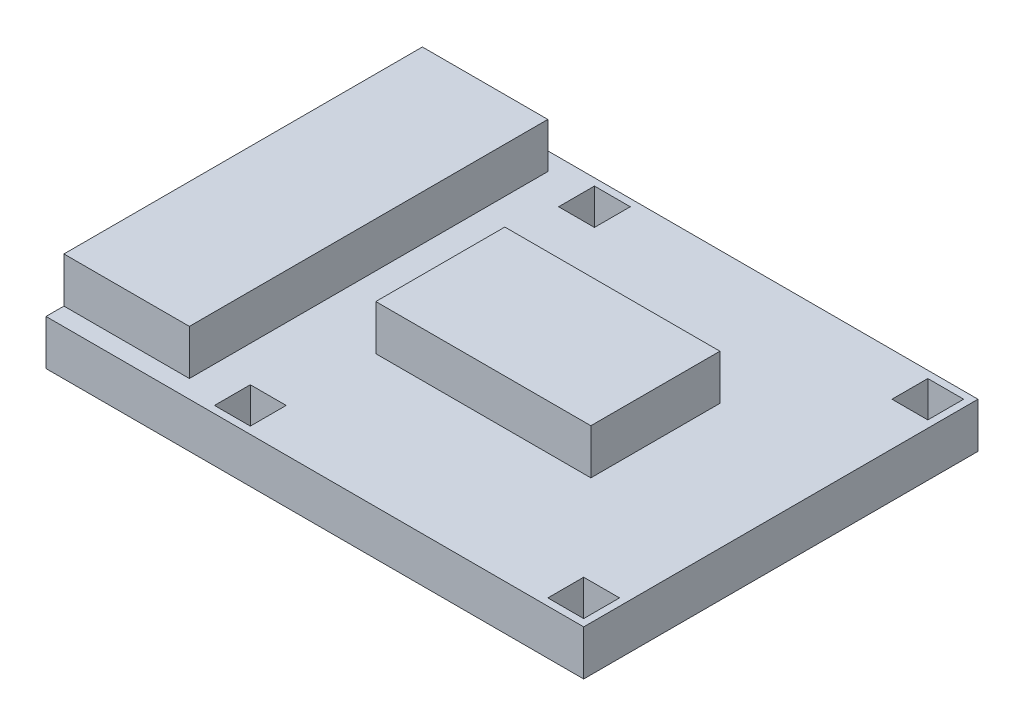
ISO-10303-21;
HEADER;
FILE_DESCRIPTION(('STEP AP214'),'2;1');
FILE_NAME('part.step','',(''),(''),'','','');
FILE_SCHEMA(('AUTOMOTIVE_DESIGN { 1 0 10303 214 1 1 1 1 }'));
ENDSEC;
DATA;
#1=APPLICATION_CONTEXT('core data for automotive mechanical design processes');
#2=APPLICATION_PROTOCOL_DEFINITION('international standard','automotive_design',2000,#1);
#3=PRODUCT_CONTEXT('',#1,'mechanical');
#4=PRODUCT('Part','Part','',(#3));
#5=PRODUCT_RELATED_PRODUCT_CATEGORY('part','',(#4));
#6=PRODUCT_DEFINITION_FORMATION('','',#4);
#7=PRODUCT_DEFINITION_CONTEXT('part definition',#1,'design');
#8=PRODUCT_DEFINITION('design','',#6,#7);
#9=PRODUCT_DEFINITION_SHAPE('','',#8);
#10=(LENGTH_UNIT() NAMED_UNIT(*) SI_UNIT(.MILLI.,.METRE.));
#11=(NAMED_UNIT(*) PLANE_ANGLE_UNIT() SI_UNIT($,.RADIAN.));
#12=(NAMED_UNIT(*) SI_UNIT($,.STERADIAN.) SOLID_ANGLE_UNIT());
#13=UNCERTAINTY_MEASURE_WITH_UNIT(LENGTH_MEASURE(1.E-05),#10,'distance_accuracy_value','');
#14=(GEOMETRIC_REPRESENTATION_CONTEXT(3) GLOBAL_UNCERTAINTY_ASSIGNED_CONTEXT((#13)) GLOBAL_UNIT_ASSIGNED_CONTEXT((#10,
#11,#12)) REPRESENTATION_CONTEXT('',''));
#15=CARTESIAN_POINT('',(0.,0.,0.));
#16=DIRECTION('',(0.,0.,1.));
#17=DIRECTION('',(1.,0.,0.));
#18=AXIS2_PLACEMENT_3D('',#15,#16,#17);
#19=CARTESIAN_POINT('',(0.,12.6,0.));
#20=DIRECTION('',(0.,1.,0.));
#21=DIRECTION('',(0.,0.,1.));
#22=AXIS2_PLACEMENT_3D('',#19,#20,#21);
#23=PLANE('',#22);
#24=DIRECTION('',(-1.,0.,0.));
#25=VECTOR('',#24,1.);
#26=CARTESIAN_POINT('',(0.,12.6,-105.));
#27=LINE('',#26,#25);
#28=CARTESIAN_POINT('',(35.,12.6,-105.));
#29=VERTEX_POINT('',#28);
#30=CARTESIAN_POINT('',(0.,12.6,-105.));
#31=VERTEX_POINT('',#30);
#32=EDGE_CURVE('E64',#29,#31,#27,.T.);
#33=ORIENTED_EDGE('',*,*,#32,.F.);
#34=DIRECTION('',(0.,0.,-1.));
#35=VECTOR('',#34,1.);
#36=CARTESIAN_POINT('',(35.,12.6,-105.));
#37=LINE('',#36,#35);
#38=CARTESIAN_POINT('',(35.,12.6,-4.99999999999999));
#39=VERTEX_POINT('',#38);
#40=EDGE_CURVE('E255',#39,#29,#37,.T.);
#41=ORIENTED_EDGE('',*,*,#40,.F.);
#42=DIRECTION('',(1.,0.,0.));
#43=VECTOR('',#42,1.);
#44=CARTESIAN_POINT('',(0.,12.6,-4.99999999999999));
#45=LINE('',#44,#43);
#46=CARTESIAN_POINT('',(0.,12.6,-4.99999999999999));
#47=VERTEX_POINT('',#46);
#48=EDGE_CURVE('E249',#47,#39,#45,.T.);
#49=ORIENTED_EDGE('',*,*,#48,.F.);
#50=DIRECTION('',(0.,0.,1.));
#51=VECTOR('',#50,1.);
#52=CARTESIAN_POINT('',(0.,12.6,-110.));
#53=LINE('',#52,#51);
#54=CARTESIAN_POINT('',(0.,12.6,0.));
#55=VERTEX_POINT('',#54);
#56=EDGE_CURVE('E506',#47,#55,#53,.T.);
#57=ORIENTED_EDGE('',*,*,#56,.T.);
#58=DIRECTION('',(1.,0.,0.));
#59=VECTOR('',#58,1.);
#60=CARTESIAN_POINT('',(0.,12.6,0.));
#61=LINE('',#60,#59);
#62=CARTESIAN_POINT('',(150.,12.6,0.));
#63=VERTEX_POINT('',#62);
#64=EDGE_CURVE('E510',#55,#63,#61,.T.);
#65=ORIENTED_EDGE('',*,*,#64,.T.);
#66=DIRECTION('',(0.,0.,-1.));
#67=VECTOR('',#66,1.);
#68=CARTESIAN_POINT('',(150.,12.6,-110.));
#69=LINE('',#68,#67);
#70=CARTESIAN_POINT('',(150.,12.6,-110.));
#71=VERTEX_POINT('',#70);
#72=EDGE_CURVE('E514',#63,#71,#69,.T.);
#73=ORIENTED_EDGE('',*,*,#72,.T.);
#74=DIRECTION('',(-1.,0.,0.));
#75=VECTOR('',#74,1.);
#76=CARTESIAN_POINT('',(0.,12.6,-110.));
#77=LINE('',#76,#75);
#78=CARTESIAN_POINT('',(0.,12.6,-110.));
#79=VERTEX_POINT('',#78);
#80=EDGE_CURVE('E518',#71,#79,#77,.T.);
#81=ORIENTED_EDGE('',*,*,#80,.T.);
#82=EDGE_CURVE('E507',#79,#31,#53,.T.);
#83=ORIENTED_EDGE('',*,*,#82,.T.);
#84=EDGE_LOOP('',(#33,#41,#49,#57,#65,#73,#81,#83));
#85=FACE_BOUND('',#84,.T.);
#86=DIRECTION('',(-1.,0.,0.));
#87=VECTOR('',#86,1.);
#88=CARTESIAN_POINT('',(45.,12.6,-108.));
#89=LINE('',#88,#87);
#90=CARTESIAN_POINT('',(55.,12.6,-108.));
#91=VERTEX_POINT('',#90);
#92=CARTESIAN_POINT('',(45.,12.6,-108.));
#93=VERTEX_POINT('',#92);
#94=EDGE_CURVE('E468',#91,#93,#89,.T.);
#95=ORIENTED_EDGE('',*,*,#94,.F.);
#96=DIRECTION('',(0.,0.,-1.));
#97=VECTOR('',#96,1.);
#98=CARTESIAN_POINT('',(55.,12.6,-108.));
#99=LINE('',#98,#97);
#100=CARTESIAN_POINT('',(55.,12.6,-98.));
#101=VERTEX_POINT('',#100);
#102=EDGE_CURVE('E465',#101,#91,#99,.T.);
#103=ORIENTED_EDGE('',*,*,#102,.F.);
#104=DIRECTION('',(1.,0.,0.));
#105=VECTOR('',#104,1.);
#106=CARTESIAN_POINT('',(45.,12.6,-98.));
#107=LINE('',#106,#105);
#108=CARTESIAN_POINT('',(45.,12.6,-98.));
#109=VERTEX_POINT('',#108);
#110=EDGE_CURVE('E476',#109,#101,#107,.T.);
#111=ORIENTED_EDGE('',*,*,#110,.F.);
#112=DIRECTION('',(0.,0.,1.));
#113=VECTOR('',#112,1.);
#114=CARTESIAN_POINT('',(45.,12.6,-108.));
#115=LINE('',#114,#113);
#116=EDGE_CURVE('E472',#93,#109,#115,.T.);
#117=ORIENTED_EDGE('',*,*,#116,.F.);
#118=EDGE_LOOP('',(#95,#103,#111,#117));
#119=FACE_BOUND('',#118,.T.);
#120=DIRECTION('',(1.,0.,0.));
#121=VECTOR('',#120,1.);
#122=CARTESIAN_POINT('',(148.,12.6,-98.));
#123=LINE('',#122,#121);
#124=CARTESIAN_POINT('',(138.,12.6,-98.));
#125=VERTEX_POINT('',#124);
#126=CARTESIAN_POINT('',(148.,12.6,-98.));
#127=VERTEX_POINT('',#126);
#128=EDGE_CURVE('E426',#125,#127,#123,.T.);
#129=ORIENTED_EDGE('',*,*,#128,.F.);
#130=DIRECTION('',(0.,0.,1.));
#131=VECTOR('',#130,1.);
#132=CARTESIAN_POINT('',(138.,12.6,-108.));
#133=LINE('',#132,#131);
#134=CARTESIAN_POINT('',(138.,12.6,-108.));
#135=VERTEX_POINT('',#134);
#136=EDGE_CURVE('E423',#135,#125,#133,.T.);
#137=ORIENTED_EDGE('',*,*,#136,.F.);
#138=DIRECTION('',(-1.,0.,0.));
#139=VECTOR('',#138,1.);
#140=CARTESIAN_POINT('',(148.,12.6,-108.));
#141=LINE('',#140,#139);
#142=CARTESIAN_POINT('',(148.,12.6,-108.));
#143=VERTEX_POINT('',#142);
#144=EDGE_CURVE('E434',#143,#135,#141,.T.);
#145=ORIENTED_EDGE('',*,*,#144,.F.);
#146=DIRECTION('',(0.,0.,-1.));
#147=VECTOR('',#146,1.);
#148=CARTESIAN_POINT('',(148.,12.6,-108.));
#149=LINE('',#148,#147);
#150=EDGE_CURVE('E430',#127,#143,#149,.T.);
#151=ORIENTED_EDGE('',*,*,#150,.F.);
#152=EDGE_LOOP('',(#129,#137,#145,#151));
#153=FACE_BOUND('',#152,.T.);
#154=DIRECTION('',(1.,0.,0.));
#155=VECTOR('',#154,1.);
#156=CARTESIAN_POINT('',(148.,12.6,-1.99999999999999));
#157=LINE('',#156,#155);
#158=CARTESIAN_POINT('',(138.,12.6,-1.99999999999999));
#159=VERTEX_POINT('',#158);
#160=CARTESIAN_POINT('',(148.,12.6,-1.99999999999999));
#161=VERTEX_POINT('',#160);
#162=EDGE_CURVE('E384',#159,#161,#157,.T.);
#163=ORIENTED_EDGE('',*,*,#162,.F.);
#164=DIRECTION('',(0.,0.,1.));
#165=VECTOR('',#164,1.);
#166=CARTESIAN_POINT('',(138.,12.6,-1.99999999999999));
#167=LINE('',#166,#165);
#168=CARTESIAN_POINT('',(138.,12.6,-12.));
#169=VERTEX_POINT('',#168);
#170=EDGE_CURVE('E381',#169,#159,#167,.T.);
#171=ORIENTED_EDGE('',*,*,#170,.F.);
#172=DIRECTION('',(-1.,0.,0.));
#173=VECTOR('',#172,1.);
#174=CARTESIAN_POINT('',(148.,12.6,-12.));
#175=LINE('',#174,#173);
#176=CARTESIAN_POINT('',(148.,12.6,-12.));
#177=VERTEX_POINT('',#176);
#178=EDGE_CURVE('E392',#177,#169,#175,.T.);
#179=ORIENTED_EDGE('',*,*,#178,.F.);
#180=DIRECTION('',(0.,0.,-1.));
#181=VECTOR('',#180,1.);
#182=CARTESIAN_POINT('',(148.,12.6,-1.99999999999999));
#183=LINE('',#182,#181);
#184=EDGE_CURVE('E388',#161,#177,#183,.T.);
#185=ORIENTED_EDGE('',*,*,#184,.F.);
#186=EDGE_LOOP('',(#163,#171,#179,#185));
#187=FACE_BOUND('',#186,.T.);
#188=DIRECTION('',(-1.,0.,0.));
#189=VECTOR('',#188,1.);
#190=CARTESIAN_POINT('',(45.,12.6,-12.));
#191=LINE('',#190,#189);
#192=CARTESIAN_POINT('',(55.,12.6,-12.));
#193=VERTEX_POINT('',#192);
#194=CARTESIAN_POINT('',(45.,12.6,-12.));
#195=VERTEX_POINT('',#194);
#196=EDGE_CURVE('E342',#193,#195,#191,.T.);
#197=ORIENTED_EDGE('',*,*,#196,.F.);
#198=DIRECTION('',(0.,0.,-1.));
#199=VECTOR('',#198,1.);
#200=CARTESIAN_POINT('',(55.,12.6,-2.));
#201=LINE('',#200,#199);
#202=CARTESIAN_POINT('',(55.,12.6,-2.));
#203=VERTEX_POINT('',#202);
#204=EDGE_CURVE('E339',#203,#193,#201,.T.);
#205=ORIENTED_EDGE('',*,*,#204,.F.);
#206=DIRECTION('',(1.,0.,0.));
#207=VECTOR('',#206,1.);
#208=CARTESIAN_POINT('',(45.,12.6,-2.));
#209=LINE('',#208,#207);
#210=CARTESIAN_POINT('',(45.,12.6,-2.));
#211=VERTEX_POINT('',#210);
#212=EDGE_CURVE('E350',#211,#203,#209,.T.);
#213=ORIENTED_EDGE('',*,*,#212,.F.);
#214=DIRECTION('',(0.,0.,1.));
#215=VECTOR('',#214,1.);
#216=CARTESIAN_POINT('',(45.,12.6,-2.));
#217=LINE('',#216,#215);
#218=EDGE_CURVE('E346',#195,#211,#217,.T.);
#219=ORIENTED_EDGE('',*,*,#218,.F.);
#220=EDGE_LOOP('',(#197,#205,#213,#219));
#221=FACE_BOUND('',#220,.T.);
#222=DIRECTION('',(1.,0.,0.));
#223=VECTOR('',#222,1.);
#224=CARTESIAN_POINT('',(55.,12.6,-37.));
#225=LINE('',#224,#223);
#226=CARTESIAN_POINT('',(55.,12.6,-37.));
#227=VERTEX_POINT('',#226);
#228=CARTESIAN_POINT('',(115.,12.6,-37.));
#229=VERTEX_POINT('',#228);
#230=EDGE_CURVE('E267',#227,#229,#225,.T.);
#231=ORIENTED_EDGE('',*,*,#230,.F.);
#232=DIRECTION('',(0.,0.,1.));
#233=VECTOR('',#232,1.);
#234=CARTESIAN_POINT('',(55.,12.6,-73.));
#235=LINE('',#234,#233);
#236=CARTESIAN_POINT('',(55.,12.6,-73.));
#237=VERTEX_POINT('',#236);
#238=EDGE_CURVE('E259',#237,#227,#235,.T.);
#239=ORIENTED_EDGE('',*,*,#238,.F.);
#240=DIRECTION('',(-1.,0.,0.));
#241=VECTOR('',#240,1.);
#242=CARTESIAN_POINT('',(55.,12.6,-73.));
#243=LINE('',#242,#241);
#244=CARTESIAN_POINT('',(115.,12.6,-73.));
#245=VERTEX_POINT('',#244);
#246=EDGE_CURVE('E233',#245,#237,#243,.T.);
#247=ORIENTED_EDGE('',*,*,#246,.F.);
#248=DIRECTION('',(0.,0.,-1.));
#249=VECTOR('',#248,1.);
#250=CARTESIAN_POINT('',(115.,12.6,-73.));
#251=LINE('',#250,#249);
#252=EDGE_CURVE('E56',#229,#245,#251,.T.);
#253=ORIENTED_EDGE('',*,*,#252,.F.);
#254=EDGE_LOOP('',(#231,#239,#247,#253));
#255=FACE_BOUND('',#254,.T.);
#256=ADVANCED_FACE('F40',(#85,#119,#153,#187,#221,#255),#23,.T.);
#257=CARTESIAN_POINT('',(0.,1.6,0.));
#258=DIRECTION('',(1.,0.,0.));
#259=DIRECTION('',(0.,0.,-1.));
#260=AXIS2_PLACEMENT_3D('',#257,#258,#259);
#261=PLANE('',#260);
#262=DIRECTION('',(0.,0.,1.));
#263=VECTOR('',#262,1.);
#264=CARTESIAN_POINT('',(0.,0.,0.));
#265=LINE('',#264,#263);
#266=CARTESIAN_POINT('',(0.,0.,-110.));
#267=VERTEX_POINT('',#266);
#268=CARTESIAN_POINT('',(0.,0.,0.));
#269=VERTEX_POINT('',#268);
#270=EDGE_CURVE('E522',#267,#269,#265,.T.);
#271=ORIENTED_EDGE('',*,*,#270,.T.);
#272=DIRECTION('',(0.,-1.,0.));
#273=VECTOR('',#272,1.);
#274=CARTESIAN_POINT('',(0.,1.6,0.));
#275=LINE('',#274,#273);
#276=EDGE_CURVE('E11',#55,#269,#275,.T.);
#277=ORIENTED_EDGE('',*,*,#276,.F.);
#278=ORIENTED_EDGE('',*,*,#56,.F.);
#279=DIRECTION('',(0.,-1.,0.));
#280=VECTOR('',#279,1.);
#281=CARTESIAN_POINT('',(0.,25.2,-4.99999999999999));
#282=LINE('',#281,#280);
#283=CARTESIAN_POINT('',(0.,25.2,-4.99999999999999));
#284=VERTEX_POINT('',#283);
#285=EDGE_CURVE('E302',#284,#47,#282,.T.);
#286=ORIENTED_EDGE('',*,*,#285,.F.);
#287=DIRECTION('',(0.,0.,1.));
#288=VECTOR('',#287,1.);
#289=CARTESIAN_POINT('',(0.,25.2,-105.));
#290=LINE('',#289,#288);
#291=CARTESIAN_POINT('',(0.,25.2,-105.));
#292=VERTEX_POINT('',#291);
#293=EDGE_CURVE('E273',#292,#284,#290,.T.);
#294=ORIENTED_EDGE('',*,*,#293,.F.);
#295=DIRECTION('',(0.,-1.,0.));
#296=VECTOR('',#295,1.);
#297=CARTESIAN_POINT('',(0.,25.2,-105.));
#298=LINE('',#297,#296);
#299=EDGE_CURVE('E285',#292,#31,#298,.T.);
#300=ORIENTED_EDGE('',*,*,#299,.T.);
#301=ORIENTED_EDGE('',*,*,#82,.F.);
#302=DIRECTION('',(0.,-1.,0.));
#303=VECTOR('',#302,1.);
#304=CARTESIAN_POINT('',(0.,1.6,-110.));
#305=LINE('',#304,#303);
#306=EDGE_CURVE('E535',#79,#267,#305,.T.);
#307=ORIENTED_EDGE('',*,*,#306,.T.);
#308=EDGE_LOOP('',(#271,#277,#278,#286,#294,#300,#301,#307));
#309=FACE_BOUND('',#308,.T.);
#310=ADVANCED_FACE('F42',(#309),#261,.F.);
#311=CARTESIAN_POINT('',(0.,1.6,0.));
#312=DIRECTION('',(0.,0.,-1.));
#313=DIRECTION('',(-1.,0.,0.));
#314=AXIS2_PLACEMENT_3D('',#311,#312,#313);
#315=PLANE('',#314);
#316=DIRECTION('',(1.,0.,0.));
#317=VECTOR('',#316,1.);
#318=CARTESIAN_POINT('',(0.,0.,0.));
#319=LINE('',#318,#317);
#320=CARTESIAN_POINT('',(150.,0.,0.));
#321=VERTEX_POINT('',#320);
#322=EDGE_CURVE('E526',#269,#321,#319,.T.);
#323=ORIENTED_EDGE('',*,*,#322,.T.);
#324=DIRECTION('',(0.,-1.,0.));
#325=VECTOR('',#324,1.);
#326=CARTESIAN_POINT('',(150.,1.6,0.));
#327=LINE('',#326,#325);
#328=EDGE_CURVE('E49',#63,#321,#327,.T.);
#329=ORIENTED_EDGE('',*,*,#328,.F.);
#330=ORIENTED_EDGE('',*,*,#64,.F.);
#331=ORIENTED_EDGE('',*,*,#276,.T.);
#332=EDGE_LOOP('',(#323,#329,#330,#331));
#333=FACE_BOUND('',#332,.T.);
#334=ADVANCED_FACE('F647',(#333),#315,.F.);
#335=CARTESIAN_POINT('',(150.,1.6,0.));
#336=DIRECTION('',(-1.,0.,0.));
#337=DIRECTION('',(0.,0.,1.));
#338=AXIS2_PLACEMENT_3D('',#335,#336,#337);
#339=PLANE('',#338);
#340=DIRECTION('',(0.,0.,-1.));
#341=VECTOR('',#340,1.);
#342=CARTESIAN_POINT('',(150.,0.,0.));
#343=LINE('',#342,#341);
#344=CARTESIAN_POINT('',(150.,0.,-110.));
#345=VERTEX_POINT('',#344);
#346=EDGE_CURVE('E529',#321,#345,#343,.T.);
#347=ORIENTED_EDGE('',*,*,#346,.T.);
#348=DIRECTION('',(0.,-1.,0.));
#349=VECTOR('',#348,1.);
#350=CARTESIAN_POINT('',(150.,1.6,-110.));
#351=LINE('',#350,#349);
#352=EDGE_CURVE('E539',#71,#345,#351,.T.);
#353=ORIENTED_EDGE('',*,*,#352,.F.);
#354=ORIENTED_EDGE('',*,*,#72,.F.);
#355=ORIENTED_EDGE('',*,*,#328,.T.);
#356=EDGE_LOOP('',(#347,#353,#354,#355));
#357=FACE_BOUND('',#356,.T.);
#358=ADVANCED_FACE('F548',(#357),#339,.F.);
#359=CARTESIAN_POINT('',(0.,1.6,-110.));
#360=DIRECTION('',(0.,0.,1.));
#361=DIRECTION('',(1.,0.,0.));
#362=AXIS2_PLACEMENT_3D('',#359,#360,#361);
#363=PLANE('',#362);
#364=DIRECTION('',(-1.,0.,0.));
#365=VECTOR('',#364,1.);
#366=CARTESIAN_POINT('',(0.,0.,-110.));
#367=LINE('',#366,#365);
#368=EDGE_CURVE('E532',#345,#267,#367,.T.);
#369=ORIENTED_EDGE('',*,*,#368,.T.);
#370=ORIENTED_EDGE('',*,*,#306,.F.);
#371=ORIENTED_EDGE('',*,*,#80,.F.);
#372=ORIENTED_EDGE('',*,*,#352,.T.);
#373=EDGE_LOOP('',(#369,#370,#371,#372));
#374=FACE_BOUND('',#373,.T.);
#375=ADVANCED_FACE('F556',(#374),#363,.F.);
#376=CARTESIAN_POINT('',(0.,0.,0.));
#377=DIRECTION('',(0.,-1.,0.));
#378=DIRECTION('',(0.,0.,-1.));
#379=AXIS2_PLACEMENT_3D('',#376,#377,#378);
#380=PLANE('',#379);
#381=CARTESIAN_POINT('',(143.,0.,-103.));
#382=DIRECTION('',(0.,1.,0.));
#383=DIRECTION('',(0.,0.,1.));
#384=AXIS2_PLACEMENT_3D('',#381,#382,#383);
#385=CIRCLE('',#384,2.15000000000001);
#386=CARTESIAN_POINT('',(143.,0.,-100.85));
#387=VERTEX_POINT('',#386);
#388=EDGE_CURVE('E310',#387,#387,#385,.T.);
#389=ORIENTED_EDGE('',*,*,#388,.T.);
#390=EDGE_LOOP('',(#389));
#391=FACE_BOUND('',#390,.T.);
#392=CARTESIAN_POINT('',(50.,0.,-103.));
#393=DIRECTION('',(0.,1.,0.));
#394=DIRECTION('',(0.,0.,1.));
#395=AXIS2_PLACEMENT_3D('',#392,#393,#394);
#396=CIRCLE('',#395,2.15);
#397=CARTESIAN_POINT('',(50.,0.,-100.85));
#398=VERTEX_POINT('',#397);
#399=EDGE_CURVE('E318',#398,#398,#396,.T.);
#400=ORIENTED_EDGE('',*,*,#399,.T.);
#401=EDGE_LOOP('',(#400));
#402=FACE_BOUND('',#401,.T.);
#403=CARTESIAN_POINT('',(50.,0.,-7.));
#404=DIRECTION('',(0.,1.,0.));
#405=DIRECTION('',(0.,0.,1.));
#406=AXIS2_PLACEMENT_3D('',#403,#404,#405);
#407=CIRCLE('',#406,2.15);
#408=CARTESIAN_POINT('',(50.,0.,-4.85));
#409=VERTEX_POINT('',#408);
#410=EDGE_CURVE('E326',#409,#409,#407,.T.);
#411=ORIENTED_EDGE('',*,*,#410,.T.);
#412=EDGE_LOOP('',(#411));
#413=FACE_BOUND('',#412,.T.);
#414=CARTESIAN_POINT('',(143.,0.,-7.));
#415=DIRECTION('',(0.,1.,0.));
#416=DIRECTION('',(0.,0.,1.));
#417=AXIS2_PLACEMENT_3D('',#414,#415,#416);
#418=CIRCLE('',#417,2.15000000000001);
#419=CARTESIAN_POINT('',(143.,0.,-4.84999999999999));
#420=VERTEX_POINT('',#419);
#421=EDGE_CURVE('E334',#420,#420,#418,.T.);
#422=ORIENTED_EDGE('',*,*,#421,.T.);
#423=EDGE_LOOP('',(#422));
#424=FACE_BOUND('',#423,.T.);
#425=ORIENTED_EDGE('',*,*,#270,.F.);
#426=ORIENTED_EDGE('',*,*,#368,.F.);
#427=ORIENTED_EDGE('',*,*,#346,.F.);
#428=ORIENTED_EDGE('',*,*,#322,.F.);
#429=EDGE_LOOP('',(#425,#426,#427,#428));
#430=FACE_BOUND('',#429,.T.);
#431=ADVANCED_FACE('F554',(#391,#402,#413,#424,#430),#380,.T.);
#432=CARTESIAN_POINT('',(55.,12.6,-108.));
#433=DIRECTION('',(-1.,0.,0.));
#434=DIRECTION('',(0.,0.,1.));
#435=AXIS2_PLACEMENT_3D('',#432,#433,#434);
#436=PLANE('',#435);
#437=DIRECTION('',(0.,0.,-1.));
#438=VECTOR('',#437,1.);
#439=CARTESIAN_POINT('',(55.,1.6,-108.));
#440=LINE('',#439,#438);
#441=CARTESIAN_POINT('',(55.,1.6,-98.));
#442=VERTEX_POINT('',#441);
#443=CARTESIAN_POINT('',(55.,1.6,-108.));
#444=VERTEX_POINT('',#443);
#445=EDGE_CURVE('E464',#442,#444,#440,.T.);
#446=ORIENTED_EDGE('',*,*,#445,.F.);
#447=DIRECTION('',(0.,-1.,0.));
#448=VECTOR('',#447,1.);
#449=CARTESIAN_POINT('',(55.,12.6,-98.));
#450=LINE('',#449,#448);
#451=EDGE_CURVE('E479',#101,#442,#450,.T.);
#452=ORIENTED_EDGE('',*,*,#451,.F.);
#453=ORIENTED_EDGE('',*,*,#102,.T.);
#454=DIRECTION('',(0.,-1.,0.));
#455=VECTOR('',#454,1.);
#456=CARTESIAN_POINT('',(55.,12.6,-108.));
#457=LINE('',#456,#455);
#458=EDGE_CURVE('E502',#91,#444,#457,.T.);
#459=ORIENTED_EDGE('',*,*,#458,.T.);
#460=EDGE_LOOP('',(#446,#452,#453,#459));
#461=FACE_BOUND('',#460,.T.);
#462=ADVANCED_FACE('F660',(#461),#436,.T.);
#463=CARTESIAN_POINT('',(45.,12.6,-108.));
#464=DIRECTION('',(0.,0.,1.));
#465=DIRECTION('',(1.,0.,0.));
#466=AXIS2_PLACEMENT_3D('',#463,#464,#465);
#467=PLANE('',#466);
#468=DIRECTION('',(-1.,0.,0.));
#469=VECTOR('',#468,1.);
#470=CARTESIAN_POINT('',(45.,1.6,-108.));
#471=LINE('',#470,#469);
#472=CARTESIAN_POINT('',(45.,1.6,-108.));
#473=VERTEX_POINT('',#472);
#474=EDGE_CURVE('E483',#444,#473,#471,.T.);
#475=ORIENTED_EDGE('',*,*,#474,.F.);
#476=ORIENTED_EDGE('',*,*,#458,.F.);
#477=ORIENTED_EDGE('',*,*,#94,.T.);
#478=DIRECTION('',(0.,-1.,0.));
#479=VECTOR('',#478,1.);
#480=CARTESIAN_POINT('',(45.,12.6,-108.));
#481=LINE('',#480,#479);
#482=EDGE_CURVE('E499',#93,#473,#481,.T.);
#483=ORIENTED_EDGE('',*,*,#482,.T.);
#484=EDGE_LOOP('',(#475,#476,#477,#483));
#485=FACE_BOUND('',#484,.T.);
#486=ADVANCED_FACE('F687',(#485),#467,.T.);
#487=CARTESIAN_POINT('',(45.,12.6,-108.));
#488=DIRECTION('',(1.,0.,0.));
#489=DIRECTION('',(0.,0.,-1.));
#490=AXIS2_PLACEMENT_3D('',#487,#488,#489);
#491=PLANE('',#490);
#492=DIRECTION('',(0.,0.,1.));
#493=VECTOR('',#492,1.);
#494=CARTESIAN_POINT('',(45.,1.6,-108.));
#495=LINE('',#494,#493);
#496=CARTESIAN_POINT('',(45.,1.6,-98.));
#497=VERTEX_POINT('',#496);
#498=EDGE_CURVE('E487',#473,#497,#495,.T.);
#499=ORIENTED_EDGE('',*,*,#498,.F.);
#500=ORIENTED_EDGE('',*,*,#482,.F.);
#501=ORIENTED_EDGE('',*,*,#116,.T.);
#502=DIRECTION('',(0.,-1.,0.));
#503=VECTOR('',#502,1.);
#504=CARTESIAN_POINT('',(45.,12.6,-98.));
#505=LINE('',#504,#503);
#506=EDGE_CURVE('E496',#109,#497,#505,.T.);
#507=ORIENTED_EDGE('',*,*,#506,.T.);
#508=EDGE_LOOP('',(#499,#500,#501,#507));
#509=FACE_BOUND('',#508,.T.);
#510=ADVANCED_FACE('F694',(#509),#491,.T.);
#511=CARTESIAN_POINT('',(45.,12.6,-98.));
#512=DIRECTION('',(0.,0.,-1.));
#513=DIRECTION('',(-1.,0.,0.));
#514=AXIS2_PLACEMENT_3D('',#511,#512,#513);
#515=PLANE('',#514);
#516=DIRECTION('',(1.,0.,0.));
#517=VECTOR('',#516,1.);
#518=CARTESIAN_POINT('',(45.,1.6,-98.));
#519=LINE('',#518,#517);
#520=EDGE_CURVE('E469',#497,#442,#519,.T.);
#521=ORIENTED_EDGE('',*,*,#520,.F.);
#522=ORIENTED_EDGE('',*,*,#506,.F.);
#523=ORIENTED_EDGE('',*,*,#110,.T.);
#524=ORIENTED_EDGE('',*,*,#451,.T.);
#525=EDGE_LOOP('',(#521,#522,#523,#524));
#526=FACE_BOUND('',#525,.T.);
#527=ADVANCED_FACE('F701',(#526),#515,.T.);
#528=CARTESIAN_POINT('',(138.,12.6,-108.));
#529=DIRECTION('',(1.,0.,0.));
#530=DIRECTION('',(0.,0.,-1.));
#531=AXIS2_PLACEMENT_3D('',#528,#529,#530);
#532=PLANE('',#531);
#533=DIRECTION('',(0.,0.,1.));
#534=VECTOR('',#533,1.);
#535=CARTESIAN_POINT('',(138.,1.6,-108.));
#536=LINE('',#535,#534);
#537=CARTESIAN_POINT('',(138.,1.6,-108.));
#538=VERTEX_POINT('',#537);
#539=CARTESIAN_POINT('',(138.,1.6,-98.));
#540=VERTEX_POINT('',#539);
#541=EDGE_CURVE('E422',#538,#540,#536,.T.);
#542=ORIENTED_EDGE('',*,*,#541,.F.);
#543=DIRECTION('',(0.,-1.,0.));
#544=VECTOR('',#543,1.);
#545=CARTESIAN_POINT('',(138.,12.6,-108.));
#546=LINE('',#545,#544);
#547=EDGE_CURVE('E437',#135,#538,#546,.T.);
#548=ORIENTED_EDGE('',*,*,#547,.F.);
#549=ORIENTED_EDGE('',*,*,#136,.T.);
#550=DIRECTION('',(0.,-1.,0.));
#551=VECTOR('',#550,1.);
#552=CARTESIAN_POINT('',(138.,12.6,-98.));
#553=LINE('',#552,#551);
#554=EDGE_CURVE('E460',#125,#540,#553,.T.);
#555=ORIENTED_EDGE('',*,*,#554,.T.);
#556=EDGE_LOOP('',(#542,#548,#549,#555));
#557=FACE_BOUND('',#556,.T.);
#558=ADVANCED_FACE('F709',(#557),#532,.T.);
#559=CARTESIAN_POINT('',(148.,12.6,-98.));
#560=DIRECTION('',(0.,0.,-1.));
#561=DIRECTION('',(-1.,0.,0.));
#562=AXIS2_PLACEMENT_3D('',#559,#560,#561);
#563=PLANE('',#562);
#564=DIRECTION('',(1.,0.,0.));
#565=VECTOR('',#564,1.);
#566=CARTESIAN_POINT('',(148.,1.6,-98.));
#567=LINE('',#566,#565);
#568=CARTESIAN_POINT('',(148.,1.6,-98.));
#569=VERTEX_POINT('',#568);
#570=EDGE_CURVE('E441',#540,#569,#567,.T.);
#571=ORIENTED_EDGE('',*,*,#570,.F.);
#572=ORIENTED_EDGE('',*,*,#554,.F.);
#573=ORIENTED_EDGE('',*,*,#128,.T.);
#574=DIRECTION('',(0.,-1.,0.));
#575=VECTOR('',#574,1.);
#576=CARTESIAN_POINT('',(148.,12.6,-98.));
#577=LINE('',#576,#575);
#578=EDGE_CURVE('E457',#127,#569,#577,.T.);
#579=ORIENTED_EDGE('',*,*,#578,.T.);
#580=EDGE_LOOP('',(#571,#572,#573,#579));
#581=FACE_BOUND('',#580,.T.);
#582=ADVANCED_FACE('F717',(#581),#563,.T.);
#583=CARTESIAN_POINT('',(148.,12.6,-108.));
#584=DIRECTION('',(-1.,0.,0.));
#585=DIRECTION('',(0.,0.,1.));
#586=AXIS2_PLACEMENT_3D('',#583,#584,#585);
#587=PLANE('',#586);
#588=DIRECTION('',(0.,0.,-1.));
#589=VECTOR('',#588,1.);
#590=CARTESIAN_POINT('',(148.,1.6,-108.));
#591=LINE('',#590,#589);
#592=CARTESIAN_POINT('',(148.,1.6,-108.));
#593=VERTEX_POINT('',#592);
#594=EDGE_CURVE('E445',#569,#593,#591,.T.);
#595=ORIENTED_EDGE('',*,*,#594,.F.);
#596=ORIENTED_EDGE('',*,*,#578,.F.);
#597=ORIENTED_EDGE('',*,*,#150,.T.);
#598=DIRECTION('',(0.,-1.,0.));
#599=VECTOR('',#598,1.);
#600=CARTESIAN_POINT('',(148.,12.6,-108.));
#601=LINE('',#600,#599);
#602=EDGE_CURVE('E454',#143,#593,#601,.T.);
#603=ORIENTED_EDGE('',*,*,#602,.T.);
#604=EDGE_LOOP('',(#595,#596,#597,#603));
#605=FACE_BOUND('',#604,.T.);
#606=ADVANCED_FACE('F725',(#605),#587,.T.);
#607=CARTESIAN_POINT('',(148.,12.6,-108.));
#608=DIRECTION('',(0.,0.,1.));
#609=DIRECTION('',(1.,0.,0.));
#610=AXIS2_PLACEMENT_3D('',#607,#608,#609);
#611=PLANE('',#610);
#612=DIRECTION('',(-1.,0.,0.));
#613=VECTOR('',#612,1.);
#614=CARTESIAN_POINT('',(148.,1.6,-108.));
#615=LINE('',#614,#613);
#616=EDGE_CURVE('E427',#593,#538,#615,.T.);
#617=ORIENTED_EDGE('',*,*,#616,.F.);
#618=ORIENTED_EDGE('',*,*,#602,.F.);
#619=ORIENTED_EDGE('',*,*,#144,.T.);
#620=ORIENTED_EDGE('',*,*,#547,.T.);
#621=EDGE_LOOP('',(#617,#618,#619,#620));
#622=FACE_BOUND('',#621,.T.);
#623=ADVANCED_FACE('F733',(#622),#611,.T.);
#624=CARTESIAN_POINT('',(138.,12.6,-1.99999999999999));
#625=DIRECTION('',(1.,0.,0.));
#626=DIRECTION('',(0.,0.,-1.));
#627=AXIS2_PLACEMENT_3D('',#624,#625,#626);
#628=PLANE('',#627);
#629=DIRECTION('',(0.,0.,1.));
#630=VECTOR('',#629,1.);
#631=CARTESIAN_POINT('',(138.,1.6,-1.99999999999999));
#632=LINE('',#631,#630);
#633=CARTESIAN_POINT('',(138.,1.6,-12.));
#634=VERTEX_POINT('',#633);
#635=CARTESIAN_POINT('',(138.,1.6,-1.99999999999999));
#636=VERTEX_POINT('',#635);
#637=EDGE_CURVE('E380',#634,#636,#632,.T.);
#638=ORIENTED_EDGE('',*,*,#637,.F.);
#639=DIRECTION('',(0.,-1.,0.));
#640=VECTOR('',#639,1.);
#641=CARTESIAN_POINT('',(138.,12.6,-12.));
#642=LINE('',#641,#640);
#643=EDGE_CURVE('E395',#169,#634,#642,.T.);
#644=ORIENTED_EDGE('',*,*,#643,.F.);
#645=ORIENTED_EDGE('',*,*,#170,.T.);
#646=DIRECTION('',(0.,-1.,0.));
#647=VECTOR('',#646,1.);
#648=CARTESIAN_POINT('',(138.,12.6,-1.99999999999999));
#649=LINE('',#648,#647);
#650=EDGE_CURVE('E418',#159,#636,#649,.T.);
#651=ORIENTED_EDGE('',*,*,#650,.T.);
#652=EDGE_LOOP('',(#638,#644,#645,#651));
#653=FACE_BOUND('',#652,.T.);
#654=ADVANCED_FACE('F741',(#653),#628,.T.);
#655=CARTESIAN_POINT('',(148.,12.6,-1.99999999999999));
#656=DIRECTION('',(0.,0.,-1.));
#657=DIRECTION('',(-1.,0.,0.));
#658=AXIS2_PLACEMENT_3D('',#655,#656,#657);
#659=PLANE('',#658);
#660=DIRECTION('',(1.,0.,0.));
#661=VECTOR('',#660,1.);
#662=CARTESIAN_POINT('',(148.,1.6,-1.99999999999999));
#663=LINE('',#662,#661);
#664=CARTESIAN_POINT('',(148.,1.6,-1.99999999999999));
#665=VERTEX_POINT('',#664);
#666=EDGE_CURVE('E399',#636,#665,#663,.T.);
#667=ORIENTED_EDGE('',*,*,#666,.F.);
#668=ORIENTED_EDGE('',*,*,#650,.F.);
#669=ORIENTED_EDGE('',*,*,#162,.T.);
#670=DIRECTION('',(0.,-1.,0.));
#671=VECTOR('',#670,1.);
#672=CARTESIAN_POINT('',(148.,12.6,-1.99999999999999));
#673=LINE('',#672,#671);
#674=EDGE_CURVE('E415',#161,#665,#673,.T.);
#675=ORIENTED_EDGE('',*,*,#674,.T.);
#676=EDGE_LOOP('',(#667,#668,#669,#675));
#677=FACE_BOUND('',#676,.T.);
#678=ADVANCED_FACE('F749',(#677),#659,.T.);
#679=CARTESIAN_POINT('',(148.,12.6,-1.99999999999999));
#680=DIRECTION('',(-1.,0.,0.));
#681=DIRECTION('',(0.,0.,1.));
#682=AXIS2_PLACEMENT_3D('',#679,#680,#681);
#683=PLANE('',#682);
#684=DIRECTION('',(0.,0.,-1.));
#685=VECTOR('',#684,1.);
#686=CARTESIAN_POINT('',(148.,1.6,-1.99999999999999));
#687=LINE('',#686,#685);
#688=CARTESIAN_POINT('',(148.,1.6,-12.));
#689=VERTEX_POINT('',#688);
#690=EDGE_CURVE('E403',#665,#689,#687,.T.);
#691=ORIENTED_EDGE('',*,*,#690,.F.);
#692=ORIENTED_EDGE('',*,*,#674,.F.);
#693=ORIENTED_EDGE('',*,*,#184,.T.);
#694=DIRECTION('',(0.,-1.,0.));
#695=VECTOR('',#694,1.);
#696=CARTESIAN_POINT('',(148.,12.6,-12.));
#697=LINE('',#696,#695);
#698=EDGE_CURVE('E412',#177,#689,#697,.T.);
#699=ORIENTED_EDGE('',*,*,#698,.T.);
#700=EDGE_LOOP('',(#691,#692,#693,#699));
#701=FACE_BOUND('',#700,.T.);
#702=ADVANCED_FACE('F757',(#701),#683,.T.);
#703=CARTESIAN_POINT('',(148.,12.6,-12.));
#704=DIRECTION('',(0.,0.,1.));
#705=DIRECTION('',(1.,0.,0.));
#706=AXIS2_PLACEMENT_3D('',#703,#704,#705);
#707=PLANE('',#706);
#708=DIRECTION('',(-1.,0.,0.));
#709=VECTOR('',#708,1.);
#710=CARTESIAN_POINT('',(148.,1.6,-12.));
#711=LINE('',#710,#709);
#712=EDGE_CURVE('E385',#689,#634,#711,.T.);
#713=ORIENTED_EDGE('',*,*,#712,.F.);
#714=ORIENTED_EDGE('',*,*,#698,.F.);
#715=ORIENTED_EDGE('',*,*,#178,.T.);
#716=ORIENTED_EDGE('',*,*,#643,.T.);
#717=EDGE_LOOP('',(#713,#714,#715,#716));
#718=FACE_BOUND('',#717,.T.);
#719=ADVANCED_FACE('F765',(#718),#707,.T.);
#720=CARTESIAN_POINT('',(55.,12.6,-2.));
#721=DIRECTION('',(-1.,0.,0.));
#722=DIRECTION('',(0.,0.,1.));
#723=AXIS2_PLACEMENT_3D('',#720,#721,#722);
#724=PLANE('',#723);
#725=DIRECTION('',(0.,0.,-1.));
#726=VECTOR('',#725,1.);
#727=CARTESIAN_POINT('',(55.,1.6,-2.));
#728=LINE('',#727,#726);
#729=CARTESIAN_POINT('',(55.,1.6,-2.));
#730=VERTEX_POINT('',#729);
#731=CARTESIAN_POINT('',(55.,1.6,-12.));
#732=VERTEX_POINT('',#731);
#733=EDGE_CURVE('E338',#730,#732,#728,.T.);
#734=ORIENTED_EDGE('',*,*,#733,.F.);
#735=DIRECTION('',(0.,-1.,0.));
#736=VECTOR('',#735,1.);
#737=CARTESIAN_POINT('',(55.,12.6,-2.));
#738=LINE('',#737,#736);
#739=EDGE_CURVE('E353',#203,#730,#738,.T.);
#740=ORIENTED_EDGE('',*,*,#739,.F.);
#741=ORIENTED_EDGE('',*,*,#204,.T.);
#742=DIRECTION('',(0.,-1.,0.));
#743=VECTOR('',#742,1.);
#744=CARTESIAN_POINT('',(55.,12.6,-12.));
#745=LINE('',#744,#743);
#746=EDGE_CURVE('E376',#193,#732,#745,.T.);
#747=ORIENTED_EDGE('',*,*,#746,.T.);
#748=EDGE_LOOP('',(#734,#740,#741,#747));
#749=FACE_BOUND('',#748,.T.);
#750=ADVANCED_FACE('F773',(#749),#724,.T.);
#751=CARTESIAN_POINT('',(45.,12.6,-12.));
#752=DIRECTION('',(0.,0.,1.));
#753=DIRECTION('',(1.,0.,0.));
#754=AXIS2_PLACEMENT_3D('',#751,#752,#753);
#755=PLANE('',#754);
#756=DIRECTION('',(-1.,0.,0.));
#757=VECTOR('',#756,1.);
#758=CARTESIAN_POINT('',(45.,1.6,-12.));
#759=LINE('',#758,#757);
#760=CARTESIAN_POINT('',(45.,1.6,-12.));
#761=VERTEX_POINT('',#760);
#762=EDGE_CURVE('E357',#732,#761,#759,.T.);
#763=ORIENTED_EDGE('',*,*,#762,.F.);
#764=ORIENTED_EDGE('',*,*,#746,.F.);
#765=ORIENTED_EDGE('',*,*,#196,.T.);
#766=DIRECTION('',(0.,-1.,0.));
#767=VECTOR('',#766,1.);
#768=CARTESIAN_POINT('',(45.,12.6,-12.));
#769=LINE('',#768,#767);
#770=EDGE_CURVE('E373',#195,#761,#769,.T.);
#771=ORIENTED_EDGE('',*,*,#770,.T.);
#772=EDGE_LOOP('',(#763,#764,#765,#771));
#773=FACE_BOUND('',#772,.T.);
#774=ADVANCED_FACE('F781',(#773),#755,.T.);
#775=CARTESIAN_POINT('',(45.,12.6,-2.));
#776=DIRECTION('',(1.,0.,0.));
#777=DIRECTION('',(0.,0.,-1.));
#778=AXIS2_PLACEMENT_3D('',#775,#776,#777);
#779=PLANE('',#778);
#780=DIRECTION('',(0.,0.,1.));
#781=VECTOR('',#780,1.);
#782=CARTESIAN_POINT('',(45.,1.6,-2.));
#783=LINE('',#782,#781);
#784=CARTESIAN_POINT('',(45.,1.6,-2.));
#785=VERTEX_POINT('',#784);
#786=EDGE_CURVE('E361',#761,#785,#783,.T.);
#787=ORIENTED_EDGE('',*,*,#786,.F.);
#788=ORIENTED_EDGE('',*,*,#770,.F.);
#789=ORIENTED_EDGE('',*,*,#218,.T.);
#790=DIRECTION('',(0.,-1.,0.));
#791=VECTOR('',#790,1.);
#792=CARTESIAN_POINT('',(45.,12.6,-2.));
#793=LINE('',#792,#791);
#794=EDGE_CURVE('E370',#211,#785,#793,.T.);
#795=ORIENTED_EDGE('',*,*,#794,.T.);
#796=EDGE_LOOP('',(#787,#788,#789,#795));
#797=FACE_BOUND('',#796,.T.);
#798=ADVANCED_FACE('F789',(#797),#779,.T.);
#799=CARTESIAN_POINT('',(45.,12.6,-2.));
#800=DIRECTION('',(0.,0.,-1.));
#801=DIRECTION('',(-1.,0.,0.));
#802=AXIS2_PLACEMENT_3D('',#799,#800,#801);
#803=PLANE('',#802);
#804=DIRECTION('',(1.,0.,0.));
#805=VECTOR('',#804,1.);
#806=CARTESIAN_POINT('',(45.,1.6,-2.));
#807=LINE('',#806,#805);
#808=EDGE_CURVE('E343',#785,#730,#807,.T.);
#809=ORIENTED_EDGE('',*,*,#808,.F.);
#810=ORIENTED_EDGE('',*,*,#794,.F.);
#811=ORIENTED_EDGE('',*,*,#212,.T.);
#812=ORIENTED_EDGE('',*,*,#739,.T.);
#813=EDGE_LOOP('',(#809,#810,#811,#812));
#814=FACE_BOUND('',#813,.T.);
#815=ADVANCED_FACE('F797',(#814),#803,.T.);
#816=CARTESIAN_POINT('',(0.,1.6,0.));
#817=DIRECTION('',(0.,-1.,0.));
#818=DIRECTION('',(0.,0.,-1.));
#819=AXIS2_PLACEMENT_3D('',#816,#817,#818);
#820=PLANE('',#819);
#821=CARTESIAN_POINT('',(143.,1.6,-103.));
#822=DIRECTION('',(0.,1.,0.));
#823=DIRECTION('',(0.,0.,1.));
#824=AXIS2_PLACEMENT_3D('',#821,#822,#823);
#825=CIRCLE('',#824,2.15000000000001);
#826=CARTESIAN_POINT('',(143.,1.6,-100.85));
#827=VERTEX_POINT('',#826);
#828=EDGE_CURVE('E306',#827,#827,#825,.T.);
#829=ORIENTED_EDGE('',*,*,#828,.F.);
#830=EDGE_LOOP('',(#829));
#831=FACE_BOUND('',#830,.T.);
#832=ORIENTED_EDGE('',*,*,#616,.T.);
#833=ORIENTED_EDGE('',*,*,#541,.T.);
#834=ORIENTED_EDGE('',*,*,#570,.T.);
#835=ORIENTED_EDGE('',*,*,#594,.T.);
#836=EDGE_LOOP('',(#832,#833,#834,#835));
#837=FACE_BOUND('',#836,.T.);
#838=ADVANCED_FACE('F668',(#831,#837),#820,.F.);
#839=CARTESIAN_POINT('',(50.,1.6,-103.));
#840=DIRECTION('',(0.,1.,0.));
#841=DIRECTION('',(0.,0.,1.));
#842=AXIS2_PLACEMENT_3D('',#839,#840,#841);
#843=CIRCLE('',#842,2.15);
#844=CARTESIAN_POINT('',(50.,1.6,-100.85));
#845=VERTEX_POINT('',#844);
#846=EDGE_CURVE('E314',#845,#845,#843,.T.);
#847=ORIENTED_EDGE('',*,*,#846,.F.);
#848=EDGE_LOOP('',(#847));
#849=FACE_BOUND('',#848,.T.);
#850=ORIENTED_EDGE('',*,*,#520,.T.);
#851=ORIENTED_EDGE('',*,*,#445,.T.);
#852=ORIENTED_EDGE('',*,*,#474,.T.);
#853=ORIENTED_EDGE('',*,*,#498,.T.);
#854=EDGE_LOOP('',(#850,#851,#852,#853));
#855=FACE_BOUND('',#854,.T.);
#856=ADVANCED_FACE('F813',(#849,#855),#820,.F.);
#857=CARTESIAN_POINT('',(143.,1.6,-7.));
#858=DIRECTION('',(0.,1.,0.));
#859=DIRECTION('',(0.,0.,1.));
#860=AXIS2_PLACEMENT_3D('',#857,#858,#859);
#861=CIRCLE('',#860,2.15000000000001);
#862=CARTESIAN_POINT('',(143.,1.6,-4.84999999999999));
#863=VERTEX_POINT('',#862);
#864=EDGE_CURVE('E330',#863,#863,#861,.T.);
#865=ORIENTED_EDGE('',*,*,#864,.F.);
#866=EDGE_LOOP('',(#865));
#867=FACE_BOUND('',#866,.T.);
#868=ORIENTED_EDGE('',*,*,#712,.T.);
#869=ORIENTED_EDGE('',*,*,#637,.T.);
#870=ORIENTED_EDGE('',*,*,#666,.T.);
#871=ORIENTED_EDGE('',*,*,#690,.T.);
#872=EDGE_LOOP('',(#868,#869,#870,#871));
#873=FACE_BOUND('',#872,.T.);
#874=ADVANCED_FACE('F666',(#867,#873),#820,.F.);
#875=CARTESIAN_POINT('',(50.,1.6,-7.));
#876=DIRECTION('',(0.,1.,0.));
#877=DIRECTION('',(0.,0.,1.));
#878=AXIS2_PLACEMENT_3D('',#875,#876,#877);
#879=CIRCLE('',#878,2.15);
#880=CARTESIAN_POINT('',(50.,1.6,-4.85));
#881=VERTEX_POINT('',#880);
#882=EDGE_CURVE('E322',#881,#881,#879,.T.);
#883=ORIENTED_EDGE('',*,*,#882,.F.);
#884=EDGE_LOOP('',(#883));
#885=FACE_BOUND('',#884,.T.);
#886=ORIENTED_EDGE('',*,*,#808,.T.);
#887=ORIENTED_EDGE('',*,*,#733,.T.);
#888=ORIENTED_EDGE('',*,*,#762,.T.);
#889=ORIENTED_EDGE('',*,*,#786,.T.);
#890=EDGE_LOOP('',(#886,#887,#888,#889));
#891=FACE_BOUND('',#890,.T.);
#892=ADVANCED_FACE('F662',(#885,#891),#820,.F.);
#893=CARTESIAN_POINT('',(143.,1.6,-7.));
#894=DIRECTION('',(0.,1.,0.));
#895=DIRECTION('',(0.,0.,1.));
#896=AXIS2_PLACEMENT_3D('',#893,#894,#895);
#897=CYLINDRICAL_SURFACE('',#896,2.15000000000001);
#898=ORIENTED_EDGE('',*,*,#421,.F.);
#899=EDGE_LOOP('',(#898));
#900=FACE_BOUND('',#899,.T.);
#901=ORIENTED_EDGE('',*,*,#864,.T.);
#902=EDGE_LOOP('',(#901));
#903=FACE_BOUND('',#902,.T.);
#904=ADVANCED_FACE('F665',(#900,#903),#897,.F.);
#905=CARTESIAN_POINT('',(50.,1.6,-7.));
#906=DIRECTION('',(0.,1.,0.));
#907=DIRECTION('',(0.,0.,1.));
#908=AXIS2_PLACEMENT_3D('',#905,#906,#907);
#909=CYLINDRICAL_SURFACE('',#908,2.15);
#910=ORIENTED_EDGE('',*,*,#410,.F.);
#911=EDGE_LOOP('',(#910));
#912=FACE_BOUND('',#911,.T.);
#913=ORIENTED_EDGE('',*,*,#882,.T.);
#914=EDGE_LOOP('',(#913));
#915=FACE_BOUND('',#914,.T.);
#916=ADVANCED_FACE('F837',(#912,#915),#909,.F.);
#917=CARTESIAN_POINT('',(50.,1.6,-103.));
#918=DIRECTION('',(0.,1.,0.));
#919=DIRECTION('',(0.,0.,1.));
#920=AXIS2_PLACEMENT_3D('',#917,#918,#919);
#921=CYLINDRICAL_SURFACE('',#920,2.15);
#922=ORIENTED_EDGE('',*,*,#399,.F.);
#923=EDGE_LOOP('',(#922));
#924=FACE_BOUND('',#923,.T.);
#925=ORIENTED_EDGE('',*,*,#846,.T.);
#926=EDGE_LOOP('',(#925));
#927=FACE_BOUND('',#926,.T.);
#928=ADVANCED_FACE('F845',(#924,#927),#921,.F.);
#929=CARTESIAN_POINT('',(143.,1.6,-103.));
#930=DIRECTION('',(0.,1.,0.));
#931=DIRECTION('',(0.,0.,1.));
#932=AXIS2_PLACEMENT_3D('',#929,#930,#931);
#933=CYLINDRICAL_SURFACE('',#932,2.15000000000001);
#934=ORIENTED_EDGE('',*,*,#388,.F.);
#935=EDGE_LOOP('',(#934));
#936=FACE_BOUND('',#935,.T.);
#937=ORIENTED_EDGE('',*,*,#828,.T.);
#938=EDGE_LOOP('',(#937));
#939=FACE_BOUND('',#938,.T.);
#940=ADVANCED_FACE('F853',(#936,#939),#933,.F.);
#941=CARTESIAN_POINT('',(0.,25.2,-4.99999999999999));
#942=DIRECTION('',(0.,0.,-1.));
#943=DIRECTION('',(-1.,0.,0.));
#944=AXIS2_PLACEMENT_3D('',#941,#942,#943);
#945=PLANE('',#944);
#946=ORIENTED_EDGE('',*,*,#48,.T.);
#947=DIRECTION('',(0.,-1.,0.));
#948=VECTOR('',#947,1.);
#949=CARTESIAN_POINT('',(35.,25.2,-4.99999999999999));
#950=LINE('',#949,#948);
#951=CARTESIAN_POINT('',(35.,25.2,-4.99999999999999));
#952=VERTEX_POINT('',#951);
#953=EDGE_CURVE('E298',#952,#39,#950,.T.);
#954=ORIENTED_EDGE('',*,*,#953,.F.);
#955=DIRECTION('',(1.,0.,0.));
#956=VECTOR('',#955,1.);
#957=CARTESIAN_POINT('',(0.,25.2,-4.99999999999999));
#958=LINE('',#957,#956);
#959=EDGE_CURVE('E277',#284,#952,#958,.T.);
#960=ORIENTED_EDGE('',*,*,#959,.F.);
#961=ORIENTED_EDGE('',*,*,#285,.T.);
#962=EDGE_LOOP('',(#946,#954,#960,#961));
#963=FACE_BOUND('',#962,.T.);
#964=ADVANCED_FACE('F574',(#963),#945,.F.);
#965=CARTESIAN_POINT('',(35.,25.2,-105.));
#966=DIRECTION('',(-1.,0.,0.));
#967=DIRECTION('',(0.,0.,1.));
#968=AXIS2_PLACEMENT_3D('',#965,#966,#967);
#969=PLANE('',#968);
#970=ORIENTED_EDGE('',*,*,#40,.T.);
#971=DIRECTION('',(0.,-1.,0.));
#972=VECTOR('',#971,1.);
#973=CARTESIAN_POINT('',(35.,25.2,-105.));
#974=LINE('',#973,#972);
#975=CARTESIAN_POINT('',(35.,25.2,-105.));
#976=VERTEX_POINT('',#975);
#977=EDGE_CURVE('E294',#976,#29,#974,.T.);
#978=ORIENTED_EDGE('',*,*,#977,.F.);
#979=DIRECTION('',(0.,0.,-1.));
#980=VECTOR('',#979,1.);
#981=CARTESIAN_POINT('',(35.,25.2,-105.));
#982=LINE('',#981,#980);
#983=EDGE_CURVE('E280',#952,#976,#982,.T.);
#984=ORIENTED_EDGE('',*,*,#983,.F.);
#985=ORIENTED_EDGE('',*,*,#953,.T.);
#986=EDGE_LOOP('',(#970,#978,#984,#985));
#987=FACE_BOUND('',#986,.T.);
#988=ADVANCED_FACE('F570',(#987),#969,.F.);
#989=CARTESIAN_POINT('',(0.,25.2,-105.));
#990=DIRECTION('',(0.,0.,1.));
#991=DIRECTION('',(1.,0.,0.));
#992=AXIS2_PLACEMENT_3D('',#989,#990,#991);
#993=PLANE('',#992);
#994=ORIENTED_EDGE('',*,*,#32,.T.);
#995=ORIENTED_EDGE('',*,*,#299,.F.);
#996=DIRECTION('',(-1.,0.,0.));
#997=VECTOR('',#996,1.);
#998=CARTESIAN_POINT('',(0.,25.2,-105.));
#999=LINE('',#998,#997);
#1000=EDGE_CURVE('E283',#976,#292,#999,.T.);
#1001=ORIENTED_EDGE('',*,*,#1000,.F.);
#1002=ORIENTED_EDGE('',*,*,#977,.T.);
#1003=EDGE_LOOP('',(#994,#995,#1001,#1002));
#1004=FACE_BOUND('',#1003,.T.);
#1005=ADVANCED_FACE('F565',(#1004),#993,.F.);
#1006=CARTESIAN_POINT('',(0.,25.2,0.));
#1007=DIRECTION('',(0.,1.,0.));
#1008=DIRECTION('',(0.,0.,1.));
#1009=AXIS2_PLACEMENT_3D('',#1006,#1007,#1008);
#1010=PLANE('',#1009);
#1011=ORIENTED_EDGE('',*,*,#293,.T.);
#1012=ORIENTED_EDGE('',*,*,#959,.T.);
#1013=ORIENTED_EDGE('',*,*,#983,.T.);
#1014=ORIENTED_EDGE('',*,*,#1000,.T.);
#1015=EDGE_LOOP('',(#1011,#1012,#1013,#1014));
#1016=FACE_BOUND('',#1015,.T.);
#1017=ADVANCED_FACE('F879',(#1016),#1010,.T.);
#1018=CARTESIAN_POINT('',(55.,95.1714227381436,-73.));
#1019=DIRECTION('',(1.,0.,0.));
#1020=DIRECTION('',(0.,0.,-1.));
#1021=AXIS2_PLACEMENT_3D('',#1018,#1019,#1020);
#1022=PLANE('',#1021);
#1023=DIRECTION('',(0.,0.,1.));
#1024=VECTOR('',#1023,1.);
#1025=CARTESIAN_POINT('',(55.,25.2,-73.));
#1026=LINE('',#1025,#1024);
#1027=CARTESIAN_POINT('',(55.,25.2,-73.));
#1028=VERTEX_POINT('',#1027);
#1029=CARTESIAN_POINT('',(55.,25.2,-37.));
#1030=VERTEX_POINT('',#1029);
#1031=EDGE_CURVE('E243',#1028,#1030,#1026,.T.);
#1032=ORIENTED_EDGE('',*,*,#1031,.F.);
#1033=DIRECTION('',(0.,-1.,0.));
#1034=VECTOR('',#1033,1.);
#1035=CARTESIAN_POINT('',(55.,95.1714227381436,-73.));
#1036=LINE('',#1035,#1034);
#1037=EDGE_CURVE('E238',#1028,#237,#1036,.T.);
#1038=ORIENTED_EDGE('',*,*,#1037,.T.);
#1039=ORIENTED_EDGE('',*,*,#238,.T.);
#1040=DIRECTION('',(0.,-1.,0.));
#1041=VECTOR('',#1040,1.);
#1042=CARTESIAN_POINT('',(55.,95.1714227381436,-37.));
#1043=LINE('',#1042,#1041);
#1044=EDGE_CURVE('E264',#1030,#227,#1043,.T.);
#1045=ORIENTED_EDGE('',*,*,#1044,.F.);
#1046=EDGE_LOOP('',(#1032,#1038,#1039,#1045));
#1047=FACE_BOUND('',#1046,.T.);
#1048=ADVANCED_FACE('F886',(#1047),#1022,.F.);
#1049=CARTESIAN_POINT('',(55.,95.1714227381436,-37.));
#1050=DIRECTION('',(0.,0.,-1.));
#1051=DIRECTION('',(-1.,0.,0.));
#1052=AXIS2_PLACEMENT_3D('',#1049,#1050,#1051);
#1053=PLANE('',#1052);
#1054=DIRECTION('',(1.,0.,0.));
#1055=VECTOR('',#1054,1.);
#1056=CARTESIAN_POINT('',(55.,25.2,-37.));
#1057=LINE('',#1056,#1055);
#1058=CARTESIAN_POINT('',(115.,25.2,-37.));
#1059=VERTEX_POINT('',#1058);
#1060=EDGE_CURVE('E247',#1030,#1059,#1057,.T.);
#1061=ORIENTED_EDGE('',*,*,#1060,.F.);
#1062=ORIENTED_EDGE('',*,*,#1044,.T.);
#1063=ORIENTED_EDGE('',*,*,#230,.T.);
#1064=DIRECTION('',(0.,-1.,0.));
#1065=VECTOR('',#1064,1.);
#1066=CARTESIAN_POINT('',(115.,95.1714227381436,-37.));
#1067=LINE('',#1066,#1065);
#1068=EDGE_CURVE('E268',#1059,#229,#1067,.T.);
#1069=ORIENTED_EDGE('',*,*,#1068,.F.);
#1070=EDGE_LOOP('',(#1061,#1062,#1063,#1069));
#1071=FACE_BOUND('',#1070,.T.);
#1072=ADVANCED_FACE('F894',(#1071),#1053,.F.);
#1073=CARTESIAN_POINT('',(115.,95.1714227381436,-73.));
#1074=DIRECTION('',(-1.,0.,0.));
#1075=DIRECTION('',(0.,0.,1.));
#1076=AXIS2_PLACEMENT_3D('',#1073,#1074,#1075);
#1077=PLANE('',#1076);
#1078=DIRECTION('',(0.,0.,-1.));
#1079=VECTOR('',#1078,1.);
#1080=CARTESIAN_POINT('',(115.,25.2,-73.));
#1081=LINE('',#1080,#1079);
#1082=CARTESIAN_POINT('',(115.,25.2,-73.));
#1083=VERTEX_POINT('',#1082);
#1084=EDGE_CURVE('E227',#1059,#1083,#1081,.T.);
#1085=ORIENTED_EDGE('',*,*,#1084,.F.);
#1086=ORIENTED_EDGE('',*,*,#1068,.T.);
#1087=ORIENTED_EDGE('',*,*,#252,.T.);
#1088=DIRECTION('',(0.,-1.,0.));
#1089=VECTOR('',#1088,1.);
#1090=CARTESIAN_POINT('',(115.,95.1714227381436,-73.));
#1091=LINE('',#1090,#1089);
#1092=EDGE_CURVE('E223',#1083,#245,#1091,.T.);
#1093=ORIENTED_EDGE('',*,*,#1092,.F.);
#1094=EDGE_LOOP('',(#1085,#1086,#1087,#1093));
#1095=FACE_BOUND('',#1094,.T.);
#1096=ADVANCED_FACE('F225',(#1095),#1077,.F.);
#1097=CARTESIAN_POINT('',(55.,95.1714227381436,-73.));
#1098=DIRECTION('',(0.,0.,1.));
#1099=DIRECTION('',(1.,0.,0.));
#1100=AXIS2_PLACEMENT_3D('',#1097,#1098,#1099);
#1101=PLANE('',#1100);
#1102=DIRECTION('',(-1.,0.,0.));
#1103=VECTOR('',#1102,1.);
#1104=CARTESIAN_POINT('',(55.,25.2,-73.));
#1105=LINE('',#1104,#1103);
#1106=EDGE_CURVE('E236',#1083,#1028,#1105,.T.);
#1107=ORIENTED_EDGE('',*,*,#1106,.F.);
#1108=ORIENTED_EDGE('',*,*,#1092,.T.);
#1109=ORIENTED_EDGE('',*,*,#246,.T.);
#1110=ORIENTED_EDGE('',*,*,#1037,.F.);
#1111=EDGE_LOOP('',(#1107,#1108,#1109,#1110));
#1112=FACE_BOUND('',#1111,.T.);
#1113=ADVANCED_FACE('F237',(#1112),#1101,.F.);
#1114=CARTESIAN_POINT('',(0.,25.2,0.));
#1115=DIRECTION('',(0.,1.,0.));
#1116=DIRECTION('',(0.,0.,1.));
#1117=AXIS2_PLACEMENT_3D('',#1114,#1115,#1116);
#1118=PLANE('',#1117);
#1119=ORIENTED_EDGE('',*,*,#1106,.T.);
#1120=ORIENTED_EDGE('',*,*,#1031,.T.);
#1121=ORIENTED_EDGE('',*,*,#1060,.T.);
#1122=ORIENTED_EDGE('',*,*,#1084,.T.);
#1123=EDGE_LOOP('',(#1119,#1120,#1121,#1122));
#1124=FACE_BOUND('',#1123,.T.);
#1125=ADVANCED_FACE('F246',(#1124),#1118,.T.);
#1126=CLOSED_SHELL('',(#256,#310,#334,#358,#375,#431,#462,#486,#510,#527,#558,#582,#606,#623,
#654,#678,#702,#719,#750,#774,#798,#815,#838,#856,#874,#892,#904,#916,#928,#940,#964,#988,#1005,
#1017,#1048,#1072,#1096,#1113,#1125));
#1127=MANIFOLD_SOLID_BREP('B2',#1126);
#1128=ADVANCED_BREP_SHAPE_REPRESENTATION('',(#18,#1127),#14);
#1129=SHAPE_DEFINITION_REPRESENTATION(#9,#1128);
ENDSEC;
END-ISO-10303-21;
